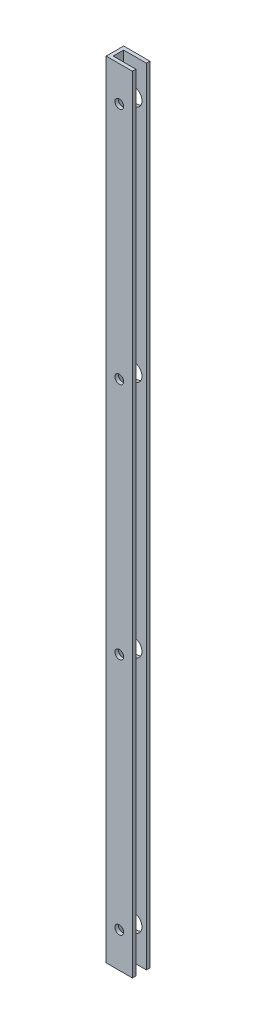
ISO-10303-21;
HEADER;
FILE_DESCRIPTION(('STEP AP214'),'2;1');
FILE_NAME('part.step','',(''),(''),'','','');
FILE_SCHEMA(('AUTOMOTIVE_DESIGN { 1 0 10303 214 1 1 1 1 }'));
ENDSEC;
DATA;
#1=APPLICATION_CONTEXT('core data for automotive mechanical design processes');
#2=APPLICATION_PROTOCOL_DEFINITION('international standard','automotive_design',2000,#1);
#3=PRODUCT_CONTEXT('',#1,'mechanical');
#4=PRODUCT('Part','Part','',(#3));
#5=PRODUCT_RELATED_PRODUCT_CATEGORY('part','',(#4));
#6=PRODUCT_DEFINITION_FORMATION('','',#4);
#7=PRODUCT_DEFINITION_CONTEXT('part definition',#1,'design');
#8=PRODUCT_DEFINITION('design','',#6,#7);
#9=PRODUCT_DEFINITION_SHAPE('','',#8);
#10=(LENGTH_UNIT() NAMED_UNIT(*) SI_UNIT(.MILLI.,.METRE.));
#11=(NAMED_UNIT(*) PLANE_ANGLE_UNIT() SI_UNIT($,.RADIAN.));
#12=(NAMED_UNIT(*) SI_UNIT($,.STERADIAN.) SOLID_ANGLE_UNIT());
#13=UNCERTAINTY_MEASURE_WITH_UNIT(LENGTH_MEASURE(1.E-05),#10,'distance_accuracy_value','');
#14=(GEOMETRIC_REPRESENTATION_CONTEXT(3) GLOBAL_UNCERTAINTY_ASSIGNED_CONTEXT((#13)) GLOBAL_UNIT_ASSIGNED_CONTEXT((#10,
#11,#12)) REPRESENTATION_CONTEXT('',''));
#15=CARTESIAN_POINT('',(0.,0.,0.));
#16=DIRECTION('',(0.,0.,1.));
#17=DIRECTION('',(1.,0.,0.));
#18=AXIS2_PLACEMENT_3D('',#15,#16,#17);
#19=CARTESIAN_POINT('',(0.,285.75,6.35));
#20=DIRECTION('',(1.,0.,0.));
#21=DIRECTION('',(0.,0.,-1.));
#22=AXIS2_PLACEMENT_3D('',#19,#20,#21);
#23=PLANE('',#22);
#24=CARTESIAN_POINT('',(0.,279.4,-0.286445318313511));
#25=DIRECTION('',(-1.,0.,0.));
#26=DIRECTION('',(0.,0.,1.));
#27=AXIS2_PLACEMENT_3D('',#24,#25,#26);
#28=CIRCLE('',#27,1.26999999999995);
#29=CARTESIAN_POINT('',(0.,279.4,0.983554681686442));
#30=VERTEX_POINT('',#29);
#31=EDGE_CURVE('E164',#30,#30,#28,.T.);
#32=ORIENTED_EDGE('',*,*,#31,.F.);
#33=EDGE_LOOP('',(#32));
#34=FACE_BOUND('',#33,.T.);
#35=CARTESIAN_POINT('',(0.,222.25,-0.286445318312916));
#36=DIRECTION('',(-1.,0.,0.));
#37=DIRECTION('',(0.,0.,1.));
#38=AXIS2_PLACEMENT_3D('',#35,#36,#37);
#39=CIRCLE('',#38,1.27);
#40=CARTESIAN_POINT('',(0.,222.25,0.983554681687081));
#41=VERTEX_POINT('',#40);
#42=EDGE_CURVE('E223',#41,#41,#39,.T.);
#43=ORIENTED_EDGE('',*,*,#42,.F.);
#44=EDGE_LOOP('',(#43));
#45=FACE_BOUND('',#44,.T.);
#46=CARTESIAN_POINT('',(0.,165.1,-0.286445318312321));
#47=DIRECTION('',(-1.,0.,0.));
#48=DIRECTION('',(0.,0.,1.));
#49=AXIS2_PLACEMENT_3D('',#46,#47,#48);
#50=CIRCLE('',#49,1.27);
#51=CARTESIAN_POINT('',(0.,165.1,0.983554681687676));
#52=VERTEX_POINT('',#51);
#53=EDGE_CURVE('E227',#52,#52,#50,.T.);
#54=ORIENTED_EDGE('',*,*,#53,.F.);
#55=EDGE_LOOP('',(#54));
#56=FACE_BOUND('',#55,.T.);
#57=CARTESIAN_POINT('',(0.,107.95,-0.286445318311725));
#58=DIRECTION('',(-1.,0.,0.));
#59=DIRECTION('',(0.,0.,1.));
#60=AXIS2_PLACEMENT_3D('',#57,#58,#59);
#61=CIRCLE('',#60,1.26999999999998);
#62=CARTESIAN_POINT('',(0.,107.95,0.983554681688252));
#63=VERTEX_POINT('',#62);
#64=EDGE_CURVE('E231',#63,#63,#61,.T.);
#65=ORIENTED_EDGE('',*,*,#64,.F.);
#66=EDGE_LOOP('',(#65));
#67=FACE_BOUND('',#66,.T.);
#68=CARTESIAN_POINT('',(0.,50.8,-0.28644531831113));
#69=DIRECTION('',(-1.,0.,0.));
#70=DIRECTION('',(0.,0.,1.));
#71=AXIS2_PLACEMENT_3D('',#68,#69,#70);
#72=CIRCLE('',#71,1.26999999999998);
#73=CARTESIAN_POINT('',(0.,50.8,0.983554681688852));
#74=VERTEX_POINT('',#73);
#75=EDGE_CURVE('E235',#74,#74,#72,.T.);
#76=ORIENTED_EDGE('',*,*,#75,.F.);
#77=EDGE_LOOP('',(#76));
#78=FACE_BOUND('',#77,.T.);
#79=CARTESIAN_POINT('',(0.,-6.35000000000002,-0.286445318310535));
#80=DIRECTION('',(-1.,0.,0.));
#81=DIRECTION('',(0.,0.,1.));
#82=AXIS2_PLACEMENT_3D('',#79,#80,#81);
#83=CIRCLE('',#82,1.26999999999998);
#84=CARTESIAN_POINT('',(0.,-6.35000000000002,0.983554681689446));
#85=VERTEX_POINT('',#84);
#86=EDGE_CURVE('E239',#85,#85,#83,.T.);
#87=ORIENTED_EDGE('',*,*,#86,.F.);
#88=EDGE_LOOP('',(#87));
#89=FACE_BOUND('',#88,.T.);
#90=CARTESIAN_POINT('',(0.,-63.5,-0.28644531830994));
#91=DIRECTION('',(-1.,0.,0.));
#92=DIRECTION('',(0.,0.,1.));
#93=AXIS2_PLACEMENT_3D('',#90,#91,#92);
#94=CIRCLE('',#93,1.26999999999998);
#95=CARTESIAN_POINT('',(0.,-63.5,0.983554681690039));
#96=VERTEX_POINT('',#95);
#97=EDGE_CURVE('E243',#96,#96,#94,.T.);
#98=ORIENTED_EDGE('',*,*,#97,.F.);
#99=EDGE_LOOP('',(#98));
#100=FACE_BOUND('',#99,.T.);
#101=CARTESIAN_POINT('',(0.,-120.65,-0.286445318309345));
#102=DIRECTION('',(-1.,0.,0.));
#103=DIRECTION('',(0.,0.,1.));
#104=AXIS2_PLACEMENT_3D('',#101,#102,#103);
#105=CIRCLE('',#104,1.26999999999998);
#106=CARTESIAN_POINT('',(0.,-120.65,0.983554681690634));
#107=VERTEX_POINT('',#106);
#108=EDGE_CURVE('E247',#107,#107,#105,.T.);
#109=ORIENTED_EDGE('',*,*,#108,.F.);
#110=EDGE_LOOP('',(#109));
#111=FACE_BOUND('',#110,.T.);
#112=CARTESIAN_POINT('',(0.,-177.8,-0.28644531830875));
#113=DIRECTION('',(-1.,0.,0.));
#114=DIRECTION('',(0.,0.,1.));
#115=AXIS2_PLACEMENT_3D('',#112,#113,#114);
#116=CIRCLE('',#115,1.27);
#117=CARTESIAN_POINT('',(0.,-177.8,0.983554681691251));
#118=VERTEX_POINT('',#117);
#119=EDGE_CURVE('E251',#118,#118,#116,.T.);
#120=ORIENTED_EDGE('',*,*,#119,.F.);
#121=EDGE_LOOP('',(#120));
#122=FACE_BOUND('',#121,.T.);
#123=CARTESIAN_POINT('',(0.,-234.95,-0.286445318308155));
#124=DIRECTION('',(-1.,0.,0.));
#125=DIRECTION('',(0.,0.,1.));
#126=AXIS2_PLACEMENT_3D('',#123,#124,#125);
#127=CIRCLE('',#126,1.27);
#128=CARTESIAN_POINT('',(0.,-234.95,0.983554681691844));
#129=VERTEX_POINT('',#128);
#130=EDGE_CURVE('E255',#129,#129,#127,.T.);
#131=ORIENTED_EDGE('',*,*,#130,.F.);
#132=EDGE_LOOP('',(#131));
#133=FACE_BOUND('',#132,.T.);
#134=DIRECTION('',(0.,0.,1.));
#135=VECTOR('',#134,1.);
#136=CARTESIAN_POINT('',(0.,-285.75,6.35));
#137=LINE('',#136,#135);
#138=CARTESIAN_POINT('',(0.,-285.75,-6.35));
#139=VERTEX_POINT('',#138);
#140=CARTESIAN_POINT('',(0.,-285.75,6.35));
#141=VERTEX_POINT('',#140);
#142=EDGE_CURVE('E134',#139,#141,#137,.T.);
#143=ORIENTED_EDGE('',*,*,#142,.T.);
#144=DIRECTION('',(0.,-1.,0.));
#145=VECTOR('',#144,1.);
#146=CARTESIAN_POINT('',(0.,285.75,6.35));
#147=LINE('',#146,#145);
#148=CARTESIAN_POINT('',(0.,285.75,6.35));
#149=VERTEX_POINT('',#148);
#150=EDGE_CURVE('E11',#149,#141,#147,.T.);
#151=ORIENTED_EDGE('',*,*,#150,.F.);
#152=DIRECTION('',(0.,0.,1.));
#153=VECTOR('',#152,1.);
#154=CARTESIAN_POINT('',(0.,285.75,6.35));
#155=LINE('',#154,#153);
#156=CARTESIAN_POINT('',(0.,285.75,-6.35));
#157=VERTEX_POINT('',#156);
#158=EDGE_CURVE('E148',#157,#149,#155,.T.);
#159=ORIENTED_EDGE('',*,*,#158,.F.);
#160=DIRECTION('',(0.,-1.,0.));
#161=VECTOR('',#160,1.);
#162=CARTESIAN_POINT('',(0.,285.75,-6.35));
#163=LINE('',#162,#161);
#164=EDGE_CURVE('E130',#157,#139,#163,.T.);
#165=ORIENTED_EDGE('',*,*,#164,.T.);
#166=EDGE_LOOP('',(#143,#151,#159,#165));
#167=FACE_BOUND('',#166,.T.);
#168=ADVANCED_FACE('F36',(#34,#45,#56,#67,#78,#89,#100,#111,#122,#133,#167),#23,.F.);
#169=CARTESIAN_POINT('',(0.,285.75,6.35));
#170=DIRECTION('',(0.,0.,-1.));
#171=DIRECTION('',(-1.,0.,0.));
#172=AXIS2_PLACEMENT_3D('',#169,#170,#171);
#173=PLANE('',#172);
#174=CARTESIAN_POINT('',(9.525,260.35,6.34999999999999));
#175=DIRECTION('',(0.,0.,-1.));
#176=DIRECTION('',(-1.,0.,0.));
#177=AXIS2_PLACEMENT_3D('',#174,#175,#176);
#178=CIRCLE('',#177,3.175);
#179=CARTESIAN_POINT('',(6.35,260.35,6.34999999999999));
#180=VERTEX_POINT('',#179);
#181=EDGE_CURVE('E275',#180,#180,#178,.T.);
#182=ORIENTED_EDGE('',*,*,#181,.T.);
#183=EDGE_LOOP('',(#182));
#184=FACE_BOUND('',#183,.T.);
#185=CARTESIAN_POINT('',(9.52499999999819,86.868,6.34999999999999));
#186=DIRECTION('',(0.,0.,-1.));
#187=DIRECTION('',(-1.,0.,0.));
#188=AXIS2_PLACEMENT_3D('',#185,#186,#187);
#189=CIRCLE('',#188,3.175);
#190=CARTESIAN_POINT('',(6.34999999999819,86.868,6.34999999999999));
#191=VERTEX_POINT('',#190);
#192=EDGE_CURVE('E287',#191,#191,#189,.T.);
#193=ORIENTED_EDGE('',*,*,#192,.T.);
#194=EDGE_LOOP('',(#193));
#195=FACE_BOUND('',#194,.T.);
#196=CARTESIAN_POINT('',(9.52499999999639,-86.614,6.34999999999999));
#197=DIRECTION('',(0.,0.,-1.));
#198=DIRECTION('',(-1.,0.,0.));
#199=AXIS2_PLACEMENT_3D('',#196,#197,#198);
#200=CIRCLE('',#199,3.175);
#201=CARTESIAN_POINT('',(6.34999999999639,-86.614,6.34999999999999));
#202=VERTEX_POINT('',#201);
#203=EDGE_CURVE('E290',#202,#202,#200,.T.);
#204=ORIENTED_EDGE('',*,*,#203,.T.);
#205=EDGE_LOOP('',(#204));
#206=FACE_BOUND('',#205,.T.);
#207=CARTESIAN_POINT('',(9.52499999999458,-260.096,6.34999999999999));
#208=DIRECTION('',(0.,0.,-1.));
#209=DIRECTION('',(-1.,0.,0.));
#210=AXIS2_PLACEMENT_3D('',#207,#208,#209);
#211=CIRCLE('',#210,3.175);
#212=CARTESIAN_POINT('',(6.34999999999458,-260.096,6.34999999999999));
#213=VERTEX_POINT('',#212);
#214=EDGE_CURVE('E293',#213,#213,#211,.T.);
#215=ORIENTED_EDGE('',*,*,#214,.T.);
#216=EDGE_LOOP('',(#215));
#217=FACE_BOUND('',#216,.T.);
#218=DIRECTION('',(1.,0.,0.));
#219=VECTOR('',#218,1.);
#220=CARTESIAN_POINT('',(0.,-285.75,6.35));
#221=LINE('',#220,#219);
#222=CARTESIAN_POINT('',(19.05,-285.75,6.35));
#223=VERTEX_POINT('',#222);
#224=EDGE_CURVE('E137',#141,#223,#221,.T.);
#225=ORIENTED_EDGE('',*,*,#224,.T.);
#226=DIRECTION('',(0.,-1.,0.));
#227=VECTOR('',#226,1.);
#228=CARTESIAN_POINT('',(19.05,285.75,6.35));
#229=LINE('',#228,#227);
#230=CARTESIAN_POINT('',(19.05,285.75,6.35));
#231=VERTEX_POINT('',#230);
#232=EDGE_CURVE('E45',#231,#223,#229,.T.);
#233=ORIENTED_EDGE('',*,*,#232,.F.);
#234=DIRECTION('',(1.,0.,0.));
#235=VECTOR('',#234,1.);
#236=CARTESIAN_POINT('',(0.,285.75,6.35));
#237=LINE('',#236,#235);
#238=EDGE_CURVE('E97',#149,#231,#237,.T.);
#239=ORIENTED_EDGE('',*,*,#238,.F.);
#240=ORIENTED_EDGE('',*,*,#150,.T.);
#241=EDGE_LOOP('',(#225,#233,#239,#240));
#242=FACE_BOUND('',#241,.T.);
#243=ADVANCED_FACE('F211',(#184,#195,#206,#217,#242),#173,.F.);
#244=CARTESIAN_POINT('',(19.05,285.75,3.81));
#245=DIRECTION('',(-1.,0.,0.));
#246=DIRECTION('',(0.,0.,1.));
#247=AXIS2_PLACEMENT_3D('',#244,#245,#246);
#248=PLANE('',#247);
#249=DIRECTION('',(0.,0.,-1.));
#250=VECTOR('',#249,1.);
#251=CARTESIAN_POINT('',(19.05,-285.75,3.81));
#252=LINE('',#251,#250);
#253=CARTESIAN_POINT('',(19.05,-285.75,3.81));
#254=VERTEX_POINT('',#253);
#255=EDGE_CURVE('E139',#223,#254,#252,.T.);
#256=ORIENTED_EDGE('',*,*,#255,.T.);
#257=DIRECTION('',(0.,-1.,0.));
#258=VECTOR('',#257,1.);
#259=CARTESIAN_POINT('',(19.05,285.75,3.81));
#260=LINE('',#259,#258);
#261=CARTESIAN_POINT('',(19.05,285.75,3.81));
#262=VERTEX_POINT('',#261);
#263=EDGE_CURVE('E155',#262,#254,#260,.T.);
#264=ORIENTED_EDGE('',*,*,#263,.F.);
#265=DIRECTION('',(0.,0.,-1.));
#266=VECTOR('',#265,1.);
#267=CARTESIAN_POINT('',(19.05,285.75,3.81));
#268=LINE('',#267,#266);
#269=EDGE_CURVE('E266',#231,#262,#268,.T.);
#270=ORIENTED_EDGE('',*,*,#269,.F.);
#271=ORIENTED_EDGE('',*,*,#232,.T.);
#272=EDGE_LOOP('',(#256,#264,#270,#271));
#273=FACE_BOUND('',#272,.T.);
#274=ADVANCED_FACE('F216',(#273),#248,.F.);
#275=CARTESIAN_POINT('',(2.54,285.75,3.81));
#276=DIRECTION('',(0.,0.,1.));
#277=DIRECTION('',(1.,0.,0.));
#278=AXIS2_PLACEMENT_3D('',#275,#276,#277);
#279=PLANE('',#278);
#280=CARTESIAN_POINT('',(9.525,260.35,3.81));
#281=DIRECTION('',(0.,0.,-1.));
#282=DIRECTION('',(-1.,0.,0.));
#283=AXIS2_PLACEMENT_3D('',#280,#281,#282);
#284=CIRCLE('',#283,3.175);
#285=CARTESIAN_POINT('',(6.35,260.35,3.81));
#286=VERTEX_POINT('',#285);
#287=EDGE_CURVE('E296',#286,#286,#284,.T.);
#288=ORIENTED_EDGE('',*,*,#287,.F.);
#289=EDGE_LOOP('',(#288));
#290=FACE_BOUND('',#289,.T.);
#291=CARTESIAN_POINT('',(9.52499999999819,86.868,3.81));
#292=DIRECTION('',(0.,0.,-1.));
#293=DIRECTION('',(-1.,0.,0.));
#294=AXIS2_PLACEMENT_3D('',#291,#292,#293);
#295=CIRCLE('',#294,3.175);
#296=CARTESIAN_POINT('',(6.34999999999819,86.868,3.81));
#297=VERTEX_POINT('',#296);
#298=EDGE_CURVE('E304',#297,#297,#295,.T.);
#299=ORIENTED_EDGE('',*,*,#298,.F.);
#300=EDGE_LOOP('',(#299));
#301=FACE_BOUND('',#300,.T.);
#302=CARTESIAN_POINT('',(9.52499999999639,-86.614,3.81));
#303=DIRECTION('',(0.,0.,-1.));
#304=DIRECTION('',(-1.,0.,0.));
#305=AXIS2_PLACEMENT_3D('',#302,#303,#304);
#306=CIRCLE('',#305,3.175);
#307=CARTESIAN_POINT('',(6.34999999999639,-86.614,3.81));
#308=VERTEX_POINT('',#307);
#309=EDGE_CURVE('E300',#308,#308,#306,.T.);
#310=ORIENTED_EDGE('',*,*,#309,.F.);
#311=EDGE_LOOP('',(#310));
#312=FACE_BOUND('',#311,.T.);
#313=CARTESIAN_POINT('',(9.52499999999458,-260.096,3.81));
#314=DIRECTION('',(0.,0.,-1.));
#315=DIRECTION('',(-1.,0.,0.));
#316=AXIS2_PLACEMENT_3D('',#313,#314,#315);
#317=CIRCLE('',#316,3.175);
#318=CARTESIAN_POINT('',(6.34999999999458,-260.096,3.81));
#319=VERTEX_POINT('',#318);
#320=EDGE_CURVE('E297',#319,#319,#317,.T.);
#321=ORIENTED_EDGE('',*,*,#320,.F.);
#322=EDGE_LOOP('',(#321));
#323=FACE_BOUND('',#322,.T.);
#324=DIRECTION('',(-1.,0.,0.));
#325=VECTOR('',#324,1.);
#326=CARTESIAN_POINT('',(2.54,-285.75,3.81));
#327=LINE('',#326,#325);
#328=CARTESIAN_POINT('',(2.54,-285.75,3.81));
#329=VERTEX_POINT('',#328);
#330=EDGE_CURVE('E141',#254,#329,#327,.T.);
#331=ORIENTED_EDGE('',*,*,#330,.T.);
#332=DIRECTION('',(0.,-1.,0.));
#333=VECTOR('',#332,1.);
#334=CARTESIAN_POINT('',(2.54,285.75,3.81));
#335=LINE('',#334,#333);
#336=CARTESIAN_POINT('',(2.54,285.75,3.81));
#337=VERTEX_POINT('',#336);
#338=EDGE_CURVE('E152',#337,#329,#335,.T.);
#339=ORIENTED_EDGE('',*,*,#338,.F.);
#340=DIRECTION('',(-1.,0.,0.));
#341=VECTOR('',#340,1.);
#342=CARTESIAN_POINT('',(2.54,285.75,3.81));
#343=LINE('',#342,#341);
#344=EDGE_CURVE('E268',#262,#337,#343,.T.);
#345=ORIENTED_EDGE('',*,*,#344,.F.);
#346=ORIENTED_EDGE('',*,*,#263,.T.);
#347=EDGE_LOOP('',(#331,#339,#345,#346));
#348=FACE_BOUND('',#347,.T.);
#349=ADVANCED_FACE('F362',(#290,#301,#312,#323,#348),#279,.F.);
#350=CARTESIAN_POINT('',(2.54,285.75,3.81));
#351=DIRECTION('',(-1.,0.,0.));
#352=DIRECTION('',(0.,0.,1.));
#353=AXIS2_PLACEMENT_3D('',#350,#351,#352);
#354=PLANE('',#353);
#355=CARTESIAN_POINT('',(2.54,279.4,-0.286445318313511));
#356=DIRECTION('',(-1.,0.,0.));
#357=DIRECTION('',(0.,0.,1.));
#358=AXIS2_PLACEMENT_3D('',#355,#356,#357);
#359=CIRCLE('',#358,1.26999999999995);
#360=CARTESIAN_POINT('',(2.54,279.4,0.983554681686442));
#361=VERTEX_POINT('',#360);
#362=EDGE_CURVE('E39',#361,#361,#359,.T.);
#363=ORIENTED_EDGE('',*,*,#362,.T.);
#364=EDGE_LOOP('',(#363));
#365=FACE_BOUND('',#364,.T.);
#366=CARTESIAN_POINT('',(2.54,222.25,-0.286445318312916));
#367=DIRECTION('',(-1.,0.,0.));
#368=DIRECTION('',(0.,0.,1.));
#369=AXIS2_PLACEMENT_3D('',#366,#367,#368);
#370=CIRCLE('',#369,1.27);
#371=CARTESIAN_POINT('',(2.54,222.25,0.983554681687081));
#372=VERTEX_POINT('',#371);
#373=EDGE_CURVE('E184',#372,#372,#370,.T.);
#374=ORIENTED_EDGE('',*,*,#373,.T.);
#375=EDGE_LOOP('',(#374));
#376=FACE_BOUND('',#375,.T.);
#377=CARTESIAN_POINT('',(2.54,165.1,-0.286445318312321));
#378=DIRECTION('',(-1.,0.,0.));
#379=DIRECTION('',(0.,0.,1.));
#380=AXIS2_PLACEMENT_3D('',#377,#378,#379);
#381=CIRCLE('',#380,1.27);
#382=CARTESIAN_POINT('',(2.54,165.1,0.983554681687676));
#383=VERTEX_POINT('',#382);
#384=EDGE_CURVE('E182',#383,#383,#381,.T.);
#385=ORIENTED_EDGE('',*,*,#384,.T.);
#386=EDGE_LOOP('',(#385));
#387=FACE_BOUND('',#386,.T.);
#388=CARTESIAN_POINT('',(2.54,107.95,-0.286445318311725));
#389=DIRECTION('',(-1.,0.,0.));
#390=DIRECTION('',(0.,0.,1.));
#391=AXIS2_PLACEMENT_3D('',#388,#389,#390);
#392=CIRCLE('',#391,1.26999999999998);
#393=CARTESIAN_POINT('',(2.54,107.95,0.983554681688252));
#394=VERTEX_POINT('',#393);
#395=EDGE_CURVE('E179',#394,#394,#392,.T.);
#396=ORIENTED_EDGE('',*,*,#395,.T.);
#397=EDGE_LOOP('',(#396));
#398=FACE_BOUND('',#397,.T.);
#399=CARTESIAN_POINT('',(2.54,50.8,-0.28644531831113));
#400=DIRECTION('',(-1.,0.,0.));
#401=DIRECTION('',(0.,0.,1.));
#402=AXIS2_PLACEMENT_3D('',#399,#400,#401);
#403=CIRCLE('',#402,1.26999999999998);
#404=CARTESIAN_POINT('',(2.54,50.8,0.983554681688852));
#405=VERTEX_POINT('',#404);
#406=EDGE_CURVE('E176',#405,#405,#403,.T.);
#407=ORIENTED_EDGE('',*,*,#406,.T.);
#408=EDGE_LOOP('',(#407));
#409=FACE_BOUND('',#408,.T.);
#410=CARTESIAN_POINT('',(2.54,-6.35000000000002,-0.286445318310535));
#411=DIRECTION('',(-1.,0.,0.));
#412=DIRECTION('',(0.,0.,1.));
#413=AXIS2_PLACEMENT_3D('',#410,#411,#412);
#414=CIRCLE('',#413,1.26999999999998);
#415=CARTESIAN_POINT('',(2.54,-6.35000000000002,0.983554681689446));
#416=VERTEX_POINT('',#415);
#417=EDGE_CURVE('E173',#416,#416,#414,.T.);
#418=ORIENTED_EDGE('',*,*,#417,.T.);
#419=EDGE_LOOP('',(#418));
#420=FACE_BOUND('',#419,.T.);
#421=CARTESIAN_POINT('',(2.54,-63.5,-0.28644531830994));
#422=DIRECTION('',(-1.,0.,0.));
#423=DIRECTION('',(0.,0.,1.));
#424=AXIS2_PLACEMENT_3D('',#421,#422,#423);
#425=CIRCLE('',#424,1.26999999999998);
#426=CARTESIAN_POINT('',(2.54,-63.5,0.983554681690039));
#427=VERTEX_POINT('',#426);
#428=EDGE_CURVE('E170',#427,#427,#425,.T.);
#429=ORIENTED_EDGE('',*,*,#428,.T.);
#430=EDGE_LOOP('',(#429));
#431=FACE_BOUND('',#430,.T.);
#432=CARTESIAN_POINT('',(2.54,-120.65,-0.286445318309345));
#433=DIRECTION('',(-1.,0.,0.));
#434=DIRECTION('',(0.,0.,1.));
#435=AXIS2_PLACEMENT_3D('',#432,#433,#434);
#436=CIRCLE('',#435,1.26999999999998);
#437=CARTESIAN_POINT('',(2.54,-120.65,0.983554681690634));
#438=VERTEX_POINT('',#437);
#439=EDGE_CURVE('E167',#438,#438,#436,.T.);
#440=ORIENTED_EDGE('',*,*,#439,.T.);
#441=EDGE_LOOP('',(#440));
#442=FACE_BOUND('',#441,.T.);
#443=CARTESIAN_POINT('',(2.54,-177.8,-0.28644531830875));
#444=DIRECTION('',(-1.,0.,0.));
#445=DIRECTION('',(0.,0.,1.));
#446=AXIS2_PLACEMENT_3D('',#443,#444,#445);
#447=CIRCLE('',#446,1.27);
#448=CARTESIAN_POINT('',(2.54,-177.8,0.983554681691251));
#449=VERTEX_POINT('',#448);
#450=EDGE_CURVE('E163',#449,#449,#447,.T.);
#451=ORIENTED_EDGE('',*,*,#450,.T.);
#452=EDGE_LOOP('',(#451));
#453=FACE_BOUND('',#452,.T.);
#454=CARTESIAN_POINT('',(2.54,-234.95,-0.286445318308155));
#455=DIRECTION('',(-1.,0.,0.));
#456=DIRECTION('',(0.,0.,1.));
#457=AXIS2_PLACEMENT_3D('',#454,#455,#456);
#458=CIRCLE('',#457,1.27);
#459=CARTESIAN_POINT('',(2.54,-234.95,0.983554681691844));
#460=VERTEX_POINT('',#459);
#461=EDGE_CURVE('E160',#460,#460,#458,.T.);
#462=ORIENTED_EDGE('',*,*,#461,.T.);
#463=EDGE_LOOP('',(#462));
#464=FACE_BOUND('',#463,.T.);
#465=DIRECTION('',(0.,0.,-1.));
#466=VECTOR('',#465,1.);
#467=CARTESIAN_POINT('',(2.54,-285.75,3.81));
#468=LINE('',#467,#466);
#469=CARTESIAN_POINT('',(2.54,-285.75,-3.81));
#470=VERTEX_POINT('',#469);
#471=EDGE_CURVE('E143',#329,#470,#468,.T.);
#472=ORIENTED_EDGE('',*,*,#471,.T.);
#473=DIRECTION('',(0.,-1.,0.));
#474=VECTOR('',#473,1.);
#475=CARTESIAN_POINT('',(2.54,285.75,-3.81));
#476=LINE('',#475,#474);
#477=CARTESIAN_POINT('',(2.54,285.75,-3.81));
#478=VERTEX_POINT('',#477);
#479=EDGE_CURVE('E125',#478,#470,#476,.T.);
#480=ORIENTED_EDGE('',*,*,#479,.F.);
#481=DIRECTION('',(0.,0.,-1.));
#482=VECTOR('',#481,1.);
#483=CARTESIAN_POINT('',(2.54,285.75,3.81));
#484=LINE('',#483,#482);
#485=EDGE_CURVE('E116',#337,#478,#484,.T.);
#486=ORIENTED_EDGE('',*,*,#485,.F.);
#487=ORIENTED_EDGE('',*,*,#338,.T.);
#488=EDGE_LOOP('',(#472,#480,#486,#487));
#489=FACE_BOUND('',#488,.T.);
#490=ADVANCED_FACE('F191',(#365,#376,#387,#398,#409,#420,#431,#442,#453,#464,#489),#354,.F.);
#491=CARTESIAN_POINT('',(2.54,285.75,-3.81));
#492=DIRECTION('',(0.,0.,-1.));
#493=DIRECTION('',(-1.,0.,0.));
#494=AXIS2_PLACEMENT_3D('',#491,#492,#493);
#495=PLANE('',#494);
#496=CARTESIAN_POINT('',(9.525,260.35,-3.81));
#497=DIRECTION('',(0.,0.,-1.));
#498=DIRECTION('',(-1.,0.,0.));
#499=AXIS2_PLACEMENT_3D('',#496,#497,#498);
#500=CIRCLE('',#499,6.34999999999999);
#501=CARTESIAN_POINT('',(3.17500000000001,260.35,-3.81));
#502=VERTEX_POINT('',#501);
#503=EDGE_CURVE('E301',#502,#502,#500,.T.);
#504=ORIENTED_EDGE('',*,*,#503,.T.);
#505=EDGE_LOOP('',(#504));
#506=FACE_BOUND('',#505,.T.);
#507=CARTESIAN_POINT('',(9.52499999999819,86.7918,-3.81));
#508=DIRECTION('',(0.,0.,-1.));
#509=DIRECTION('',(-1.,0.,0.));
#510=AXIS2_PLACEMENT_3D('',#507,#508,#509);
#511=CIRCLE('',#510,6.34999999999999);
#512=CARTESIAN_POINT('',(3.1749999999982,86.7918,-3.81));
#513=VERTEX_POINT('',#512);
#514=EDGE_CURVE('E311',#513,#513,#511,.T.);
#515=ORIENTED_EDGE('',*,*,#514,.T.);
#516=EDGE_LOOP('',(#515));
#517=FACE_BOUND('',#516,.T.);
#518=CARTESIAN_POINT('',(9.52499999999639,-86.7664,-3.81));
#519=DIRECTION('',(0.,0.,-1.));
#520=DIRECTION('',(-1.,0.,0.));
#521=AXIS2_PLACEMENT_3D('',#518,#519,#520);
#522=CIRCLE('',#521,6.34999999999999);
#523=CARTESIAN_POINT('',(3.17499999999639,-86.7664,-3.81));
#524=VERTEX_POINT('',#523);
#525=EDGE_CURVE('E314',#524,#524,#522,.T.);
#526=ORIENTED_EDGE('',*,*,#525,.T.);
#527=EDGE_LOOP('',(#526));
#528=FACE_BOUND('',#527,.T.);
#529=CARTESIAN_POINT('',(9.52499999999458,-260.3246,-3.81));
#530=DIRECTION('',(0.,0.,-1.));
#531=DIRECTION('',(-1.,0.,0.));
#532=AXIS2_PLACEMENT_3D('',#529,#530,#531);
#533=CIRCLE('',#532,6.34999999999999);
#534=CARTESIAN_POINT('',(3.17499999999459,-260.3246,-3.81));
#535=VERTEX_POINT('',#534);
#536=EDGE_CURVE('E317',#535,#535,#533,.T.);
#537=ORIENTED_EDGE('',*,*,#536,.T.);
#538=EDGE_LOOP('',(#537));
#539=FACE_BOUND('',#538,.T.);
#540=DIRECTION('',(1.,0.,0.));
#541=VECTOR('',#540,1.);
#542=CARTESIAN_POINT('',(2.54,-285.75,-3.81));
#543=LINE('',#542,#541);
#544=CARTESIAN_POINT('',(19.05,-285.75,-3.81));
#545=VERTEX_POINT('',#544);
#546=EDGE_CURVE('E124',#470,#545,#543,.T.);
#547=ORIENTED_EDGE('',*,*,#546,.T.);
#548=DIRECTION('',(0.,-1.,0.));
#549=VECTOR('',#548,1.);
#550=CARTESIAN_POINT('',(19.05,285.75,-3.81));
#551=LINE('',#550,#549);
#552=CARTESIAN_POINT('',(19.05,285.75,-3.81));
#553=VERTEX_POINT('',#552);
#554=EDGE_CURVE('E121',#553,#545,#551,.T.);
#555=ORIENTED_EDGE('',*,*,#554,.F.);
#556=DIRECTION('',(1.,0.,0.));
#557=VECTOR('',#556,1.);
#558=CARTESIAN_POINT('',(2.54,285.75,-3.81));
#559=LINE('',#558,#557);
#560=EDGE_CURVE('E110',#478,#553,#559,.T.);
#561=ORIENTED_EDGE('',*,*,#560,.F.);
#562=ORIENTED_EDGE('',*,*,#479,.T.);
#563=EDGE_LOOP('',(#547,#555,#561,#562));
#564=FACE_BOUND('',#563,.T.);
#565=ADVANCED_FACE('F122',(#506,#517,#528,#539,#564),#495,.F.);
#566=CARTESIAN_POINT('',(19.05,285.75,-3.81));
#567=DIRECTION('',(-1.,0.,0.));
#568=DIRECTION('',(0.,0.,1.));
#569=AXIS2_PLACEMENT_3D('',#566,#567,#568);
#570=PLANE('',#569);
#571=DIRECTION('',(0.,0.,-1.));
#572=VECTOR('',#571,1.);
#573=CARTESIAN_POINT('',(19.05,-285.75,-3.81));
#574=LINE('',#573,#572);
#575=CARTESIAN_POINT('',(19.05,-285.75,-6.35));
#576=VERTEX_POINT('',#575);
#577=EDGE_CURVE('E83',#545,#576,#574,.T.);
#578=ORIENTED_EDGE('',*,*,#577,.T.);
#579=DIRECTION('',(0.,-1.,0.));
#580=VECTOR('',#579,1.);
#581=CARTESIAN_POINT('',(19.05,285.75,-6.35));
#582=LINE('',#581,#580);
#583=CARTESIAN_POINT('',(19.05,285.75,-6.35));
#584=VERTEX_POINT('',#583);
#585=EDGE_CURVE('E126',#584,#576,#582,.T.);
#586=ORIENTED_EDGE('',*,*,#585,.F.);
#587=DIRECTION('',(0.,0.,-1.));
#588=VECTOR('',#587,1.);
#589=CARTESIAN_POINT('',(19.05,285.75,-3.81));
#590=LINE('',#589,#588);
#591=EDGE_CURVE('E114',#553,#584,#590,.T.);
#592=ORIENTED_EDGE('',*,*,#591,.F.);
#593=ORIENTED_EDGE('',*,*,#554,.T.);
#594=EDGE_LOOP('',(#578,#586,#592,#593));
#595=FACE_BOUND('',#594,.T.);
#596=ADVANCED_FACE('F128',(#595),#570,.F.);
#597=CARTESIAN_POINT('',(0.,285.75,-6.35));
#598=DIRECTION('',(0.,0.,1.));
#599=DIRECTION('',(1.,0.,0.));
#600=AXIS2_PLACEMENT_3D('',#597,#598,#599);
#601=PLANE('',#600);
#602=CARTESIAN_POINT('',(9.525,260.35,-6.35));
#603=DIRECTION('',(0.,0.,-1.));
#604=DIRECTION('',(-1.,0.,0.));
#605=AXIS2_PLACEMENT_3D('',#602,#603,#604);
#606=CIRCLE('',#605,6.34999999999999);
#607=CARTESIAN_POINT('',(3.17500000000001,260.35,-6.35));
#608=VERTEX_POINT('',#607);
#609=EDGE_CURVE('E320',#608,#608,#606,.T.);
#610=ORIENTED_EDGE('',*,*,#609,.F.);
#611=EDGE_LOOP('',(#610));
#612=FACE_BOUND('',#611,.T.);
#613=CARTESIAN_POINT('',(9.52499999999819,86.7918,-6.35));
#614=DIRECTION('',(0.,0.,-1.));
#615=DIRECTION('',(-1.,0.,0.));
#616=AXIS2_PLACEMENT_3D('',#613,#614,#615);
#617=CIRCLE('',#616,6.34999999999999);
#618=CARTESIAN_POINT('',(3.1749999999982,86.7918,-6.35));
#619=VERTEX_POINT('',#618);
#620=EDGE_CURVE('E327',#619,#619,#617,.T.);
#621=ORIENTED_EDGE('',*,*,#620,.F.);
#622=EDGE_LOOP('',(#621));
#623=FACE_BOUND('',#622,.T.);
#624=CARTESIAN_POINT('',(9.52499999999639,-86.7664,-6.35));
#625=DIRECTION('',(0.,0.,-1.));
#626=DIRECTION('',(-1.,0.,0.));
#627=AXIS2_PLACEMENT_3D('',#624,#625,#626);
#628=CIRCLE('',#627,6.34999999999999);
#629=CARTESIAN_POINT('',(3.17499999999639,-86.7664,-6.35));
#630=VERTEX_POINT('',#629);
#631=EDGE_CURVE('E324',#630,#630,#628,.T.);
#632=ORIENTED_EDGE('',*,*,#631,.F.);
#633=EDGE_LOOP('',(#632));
#634=FACE_BOUND('',#633,.T.);
#635=CARTESIAN_POINT('',(9.52499999999458,-260.3246,-6.35));
#636=DIRECTION('',(0.,0.,-1.));
#637=DIRECTION('',(-1.,0.,0.));
#638=AXIS2_PLACEMENT_3D('',#635,#636,#637);
#639=CIRCLE('',#638,6.34999999999999);
#640=CARTESIAN_POINT('',(3.17499999999459,-260.3246,-6.35));
#641=VERTEX_POINT('',#640);
#642=EDGE_CURVE('E321',#641,#641,#639,.T.);
#643=ORIENTED_EDGE('',*,*,#642,.F.);
#644=EDGE_LOOP('',(#643));
#645=FACE_BOUND('',#644,.T.);
#646=DIRECTION('',(-1.,0.,0.));
#647=VECTOR('',#646,1.);
#648=CARTESIAN_POINT('',(0.,-285.75,-6.35));
#649=LINE('',#648,#647);
#650=EDGE_CURVE('E89',#576,#139,#649,.T.);
#651=ORIENTED_EDGE('',*,*,#650,.T.);
#652=ORIENTED_EDGE('',*,*,#164,.F.);
#653=DIRECTION('',(-1.,0.,0.));
#654=VECTOR('',#653,1.);
#655=CARTESIAN_POINT('',(0.,285.75,-6.35));
#656=LINE('',#655,#654);
#657=EDGE_CURVE('E54',#584,#157,#656,.T.);
#658=ORIENTED_EDGE('',*,*,#657,.F.);
#659=ORIENTED_EDGE('',*,*,#585,.T.);
#660=EDGE_LOOP('',(#651,#652,#658,#659));
#661=FACE_BOUND('',#660,.T.);
#662=ADVANCED_FACE('F336',(#612,#623,#634,#645,#661),#601,.F.);
#663=CARTESIAN_POINT('',(0.,285.75,0.));
#664=DIRECTION('',(0.,-1.,0.));
#665=DIRECTION('',(0.,0.,-1.));
#666=AXIS2_PLACEMENT_3D('',#663,#664,#665);
#667=PLANE('',#666);
#668=ORIENTED_EDGE('',*,*,#158,.T.);
#669=ORIENTED_EDGE('',*,*,#238,.T.);
#670=ORIENTED_EDGE('',*,*,#269,.T.);
#671=ORIENTED_EDGE('',*,*,#344,.T.);
#672=ORIENTED_EDGE('',*,*,#485,.T.);
#673=ORIENTED_EDGE('',*,*,#560,.T.);
#674=ORIENTED_EDGE('',*,*,#591,.T.);
#675=ORIENTED_EDGE('',*,*,#657,.T.);
#676=EDGE_LOOP('',(#668,#669,#670,#671,#672,#673,#674,#675));
#677=FACE_BOUND('',#676,.T.);
#678=ADVANCED_FACE('F112',(#677),#667,.F.);
#679=CARTESIAN_POINT('',(0.,-285.75,0.));
#680=DIRECTION('',(0.,-1.,0.));
#681=DIRECTION('',(0.,0.,-1.));
#682=AXIS2_PLACEMENT_3D('',#679,#680,#681);
#683=PLANE('',#682);
#684=ORIENTED_EDGE('',*,*,#142,.F.);
#685=ORIENTED_EDGE('',*,*,#650,.F.);
#686=ORIENTED_EDGE('',*,*,#577,.F.);
#687=ORIENTED_EDGE('',*,*,#546,.F.);
#688=ORIENTED_EDGE('',*,*,#471,.F.);
#689=ORIENTED_EDGE('',*,*,#330,.F.);
#690=ORIENTED_EDGE('',*,*,#255,.F.);
#691=ORIENTED_EDGE('',*,*,#224,.F.);
#692=EDGE_LOOP('',(#684,#685,#686,#687,#688,#689,#690,#691));
#693=FACE_BOUND('',#692,.T.);
#694=ADVANCED_FACE('F260',(#693),#683,.T.);
#695=CARTESIAN_POINT('',(19.05,-234.95,-0.286445318308155));
#696=DIRECTION('',(-1.,0.,0.));
#697=DIRECTION('',(0.,0.,1.));
#698=AXIS2_PLACEMENT_3D('',#695,#696,#697);
#699=CYLINDRICAL_SURFACE('',#698,1.27);
#700=ORIENTED_EDGE('',*,*,#130,.T.);
#701=EDGE_LOOP('',(#700));
#702=FACE_BOUND('',#701,.T.);
#703=ORIENTED_EDGE('',*,*,#461,.F.);
#704=EDGE_LOOP('',(#703));
#705=FACE_BOUND('',#704,.T.);
#706=ADVANCED_FACE('F393',(#702,#705),#699,.F.);
#707=CARTESIAN_POINT('',(19.05,-177.8,-0.28644531830875));
#708=DIRECTION('',(-1.,0.,0.));
#709=DIRECTION('',(0.,0.,1.));
#710=AXIS2_PLACEMENT_3D('',#707,#708,#709);
#711=CYLINDRICAL_SURFACE('',#710,1.27);
#712=ORIENTED_EDGE('',*,*,#119,.T.);
#713=EDGE_LOOP('',(#712));
#714=FACE_BOUND('',#713,.T.);
#715=ORIENTED_EDGE('',*,*,#450,.F.);
#716=EDGE_LOOP('',(#715));
#717=FACE_BOUND('',#716,.T.);
#718=ADVANCED_FACE('F398',(#714,#717),#711,.F.);
#719=CARTESIAN_POINT('',(19.05,-120.65,-0.286445318309345));
#720=DIRECTION('',(-1.,0.,0.));
#721=DIRECTION('',(0.,0.,1.));
#722=AXIS2_PLACEMENT_3D('',#719,#720,#721);
#723=CYLINDRICAL_SURFACE('',#722,1.26999999999998);
#724=ORIENTED_EDGE('',*,*,#108,.T.);
#725=EDGE_LOOP('',(#724));
#726=FACE_BOUND('',#725,.T.);
#727=ORIENTED_EDGE('',*,*,#439,.F.);
#728=EDGE_LOOP('',(#727));
#729=FACE_BOUND('',#728,.T.);
#730=ADVANCED_FACE('F410',(#726,#729),#723,.F.);
#731=CARTESIAN_POINT('',(19.05,-63.5,-0.28644531830994));
#732=DIRECTION('',(-1.,0.,0.));
#733=DIRECTION('',(0.,0.,1.));
#734=AXIS2_PLACEMENT_3D('',#731,#732,#733);
#735=CYLINDRICAL_SURFACE('',#734,1.26999999999998);
#736=ORIENTED_EDGE('',*,*,#97,.T.);
#737=EDGE_LOOP('',(#736));
#738=FACE_BOUND('',#737,.T.);
#739=ORIENTED_EDGE('',*,*,#428,.F.);
#740=EDGE_LOOP('',(#739));
#741=FACE_BOUND('',#740,.T.);
#742=ADVANCED_FACE('F420',(#738,#741),#735,.F.);
#743=CARTESIAN_POINT('',(19.05,-6.35000000000002,-0.286445318310535));
#744=DIRECTION('',(-1.,0.,0.));
#745=DIRECTION('',(0.,0.,1.));
#746=AXIS2_PLACEMENT_3D('',#743,#744,#745);
#747=CYLINDRICAL_SURFACE('',#746,1.26999999999998);
#748=ORIENTED_EDGE('',*,*,#86,.T.);
#749=EDGE_LOOP('',(#748));
#750=FACE_BOUND('',#749,.T.);
#751=ORIENTED_EDGE('',*,*,#417,.F.);
#752=EDGE_LOOP('',(#751));
#753=FACE_BOUND('',#752,.T.);
#754=ADVANCED_FACE('F430',(#750,#753),#747,.F.);
#755=CARTESIAN_POINT('',(19.05,50.8,-0.28644531831113));
#756=DIRECTION('',(-1.,0.,0.));
#757=DIRECTION('',(0.,0.,1.));
#758=AXIS2_PLACEMENT_3D('',#755,#756,#757);
#759=CYLINDRICAL_SURFACE('',#758,1.26999999999998);
#760=ORIENTED_EDGE('',*,*,#75,.T.);
#761=EDGE_LOOP('',(#760));
#762=FACE_BOUND('',#761,.T.);
#763=ORIENTED_EDGE('',*,*,#406,.F.);
#764=EDGE_LOOP('',(#763));
#765=FACE_BOUND('',#764,.T.);
#766=ADVANCED_FACE('F440',(#762,#765),#759,.F.);
#767=CARTESIAN_POINT('',(19.05,107.95,-0.286445318311725));
#768=DIRECTION('',(-1.,0.,0.));
#769=DIRECTION('',(0.,0.,1.));
#770=AXIS2_PLACEMENT_3D('',#767,#768,#769);
#771=CYLINDRICAL_SURFACE('',#770,1.26999999999998);
#772=ORIENTED_EDGE('',*,*,#64,.T.);
#773=EDGE_LOOP('',(#772));
#774=FACE_BOUND('',#773,.T.);
#775=ORIENTED_EDGE('',*,*,#395,.F.);
#776=EDGE_LOOP('',(#775));
#777=FACE_BOUND('',#776,.T.);
#778=ADVANCED_FACE('F450',(#774,#777),#771,.F.);
#779=CARTESIAN_POINT('',(19.05,165.1,-0.286445318312321));
#780=DIRECTION('',(-1.,0.,0.));
#781=DIRECTION('',(0.,0.,1.));
#782=AXIS2_PLACEMENT_3D('',#779,#780,#781);
#783=CYLINDRICAL_SURFACE('',#782,1.27);
#784=ORIENTED_EDGE('',*,*,#53,.T.);
#785=EDGE_LOOP('',(#784));
#786=FACE_BOUND('',#785,.T.);
#787=ORIENTED_EDGE('',*,*,#384,.F.);
#788=EDGE_LOOP('',(#787));
#789=FACE_BOUND('',#788,.T.);
#790=ADVANCED_FACE('F206',(#786,#789),#783,.F.);
#791=CARTESIAN_POINT('',(19.05,222.25,-0.286445318312916));
#792=DIRECTION('',(-1.,0.,0.));
#793=DIRECTION('',(0.,0.,1.));
#794=AXIS2_PLACEMENT_3D('',#791,#792,#793);
#795=CYLINDRICAL_SURFACE('',#794,1.27);
#796=ORIENTED_EDGE('',*,*,#42,.T.);
#797=EDGE_LOOP('',(#796));
#798=FACE_BOUND('',#797,.T.);
#799=ORIENTED_EDGE('',*,*,#373,.F.);
#800=EDGE_LOOP('',(#799));
#801=FACE_BOUND('',#800,.T.);
#802=ADVANCED_FACE('F196',(#798,#801),#795,.F.);
#803=CARTESIAN_POINT('',(19.05,279.4,-0.286445318313511));
#804=DIRECTION('',(-1.,0.,0.));
#805=DIRECTION('',(0.,0.,1.));
#806=AXIS2_PLACEMENT_3D('',#803,#804,#805);
#807=CYLINDRICAL_SURFACE('',#806,1.26999999999995);
#808=ORIENTED_EDGE('',*,*,#31,.T.);
#809=EDGE_LOOP('',(#808));
#810=FACE_BOUND('',#809,.T.);
#811=ORIENTED_EDGE('',*,*,#362,.F.);
#812=EDGE_LOOP('',(#811));
#813=FACE_BOUND('',#812,.T.);
#814=ADVANCED_FACE('F193',(#810,#813),#807,.F.);
#815=CARTESIAN_POINT('',(9.52499999999459,-260.096,144.018));
#816=DIRECTION('',(0.,0.,-1.));
#817=DIRECTION('',(-1.,0.,0.));
#818=AXIS2_PLACEMENT_3D('',#815,#816,#817);
#819=CYLINDRICAL_SURFACE('',#818,3.175);
#820=ORIENTED_EDGE('',*,*,#320,.T.);
#821=EDGE_LOOP('',(#820));
#822=FACE_BOUND('',#821,.T.);
#823=ORIENTED_EDGE('',*,*,#214,.F.);
#824=EDGE_LOOP('',(#823));
#825=FACE_BOUND('',#824,.T.);
#826=ADVANCED_FACE('F195',(#822,#825),#819,.F.);
#827=CARTESIAN_POINT('',(9.5249999999964,-86.614,144.018));
#828=DIRECTION('',(0.,0.,-1.));
#829=DIRECTION('',(-1.,0.,0.));
#830=AXIS2_PLACEMENT_3D('',#827,#828,#829);
#831=CYLINDRICAL_SURFACE('',#830,3.175);
#832=ORIENTED_EDGE('',*,*,#309,.T.);
#833=EDGE_LOOP('',(#832));
#834=FACE_BOUND('',#833,.T.);
#835=ORIENTED_EDGE('',*,*,#203,.F.);
#836=EDGE_LOOP('',(#835));
#837=FACE_BOUND('',#836,.T.);
#838=ADVANCED_FACE('F203',(#834,#837),#831,.F.);
#839=CARTESIAN_POINT('',(9.52499999999821,86.868,144.018));
#840=DIRECTION('',(0.,0.,-1.));
#841=DIRECTION('',(-1.,0.,0.));
#842=AXIS2_PLACEMENT_3D('',#839,#840,#841);
#843=CYLINDRICAL_SURFACE('',#842,3.175);
#844=ORIENTED_EDGE('',*,*,#298,.T.);
#845=EDGE_LOOP('',(#844));
#846=FACE_BOUND('',#845,.T.);
#847=ORIENTED_EDGE('',*,*,#192,.F.);
#848=EDGE_LOOP('',(#847));
#849=FACE_BOUND('',#848,.T.);
#850=ADVANCED_FACE('F503',(#846,#849),#843,.F.);
#851=CARTESIAN_POINT('',(9.52500000000001,260.35,144.018));
#852=DIRECTION('',(0.,0.,-1.));
#853=DIRECTION('',(-1.,0.,0.));
#854=AXIS2_PLACEMENT_3D('',#851,#852,#853);
#855=CYLINDRICAL_SURFACE('',#854,3.175);
#856=ORIENTED_EDGE('',*,*,#287,.T.);
#857=EDGE_LOOP('',(#856));
#858=FACE_BOUND('',#857,.T.);
#859=ORIENTED_EDGE('',*,*,#181,.F.);
#860=EDGE_LOOP('',(#859));
#861=FACE_BOUND('',#860,.T.);
#862=ADVANCED_FACE('F350',(#858,#861),#855,.F.);
#863=CARTESIAN_POINT('',(9.52499999999458,-260.3246,0.));
#864=DIRECTION('',(0.,0.,-1.));
#865=DIRECTION('',(-1.,0.,0.));
#866=AXIS2_PLACEMENT_3D('',#863,#864,#865);
#867=CYLINDRICAL_SURFACE('',#866,6.34999999999999);
#868=ORIENTED_EDGE('',*,*,#642,.T.);
#869=EDGE_LOOP('',(#868));
#870=FACE_BOUND('',#869,.T.);
#871=ORIENTED_EDGE('',*,*,#536,.F.);
#872=EDGE_LOOP('',(#871));
#873=FACE_BOUND('',#872,.T.);
#874=ADVANCED_FACE('F346',(#870,#873),#867,.F.);
#875=CARTESIAN_POINT('',(9.52499999999639,-86.7664,0.));
#876=DIRECTION('',(0.,0.,-1.));
#877=DIRECTION('',(-1.,0.,0.));
#878=AXIS2_PLACEMENT_3D('',#875,#876,#877);
#879=CYLINDRICAL_SURFACE('',#878,6.34999999999999);
#880=ORIENTED_EDGE('',*,*,#631,.T.);
#881=EDGE_LOOP('',(#880));
#882=FACE_BOUND('',#881,.T.);
#883=ORIENTED_EDGE('',*,*,#525,.F.);
#884=EDGE_LOOP('',(#883));
#885=FACE_BOUND('',#884,.T.);
#886=ADVANCED_FACE('F349',(#882,#885),#879,.F.);
#887=CARTESIAN_POINT('',(9.52499999999819,86.7918,0.));
#888=DIRECTION('',(0.,0.,-1.));
#889=DIRECTION('',(-1.,0.,0.));
#890=AXIS2_PLACEMENT_3D('',#887,#888,#889);
#891=CYLINDRICAL_SURFACE('',#890,6.34999999999999);
#892=ORIENTED_EDGE('',*,*,#620,.T.);
#893=EDGE_LOOP('',(#892));
#894=FACE_BOUND('',#893,.T.);
#895=ORIENTED_EDGE('',*,*,#514,.F.);
#896=EDGE_LOOP('',(#895));
#897=FACE_BOUND('',#896,.T.);
#898=ADVANCED_FACE('F534',(#894,#897),#891,.F.);
#899=CARTESIAN_POINT('',(9.525,260.35,0.));
#900=DIRECTION('',(0.,0.,-1.));
#901=DIRECTION('',(-1.,0.,0.));
#902=AXIS2_PLACEMENT_3D('',#899,#900,#901);
#903=CYLINDRICAL_SURFACE('',#902,6.34999999999999);
#904=ORIENTED_EDGE('',*,*,#609,.T.);
#905=EDGE_LOOP('',(#904));
#906=FACE_BOUND('',#905,.T.);
#907=ORIENTED_EDGE('',*,*,#503,.F.);
#908=EDGE_LOOP('',(#907));
#909=FACE_BOUND('',#908,.T.);
#910=ADVANCED_FACE('F333',(#906,#909),#903,.F.);
#911=CLOSED_SHELL('',(#168,#243,#274,#349,#490,#565,#596,#662,#678,#694,#706,#718,#730,#742,
#754,#766,#778,#790,#802,#814,#826,#838,#850,#862,#874,#886,#898,#910));
#912=MANIFOLD_SOLID_BREP('B2',#911);
#913=ADVANCED_BREP_SHAPE_REPRESENTATION('',(#18,#912),#14);
#914=SHAPE_DEFINITION_REPRESENTATION(#9,#913);
ENDSEC;
END-ISO-10303-21;
